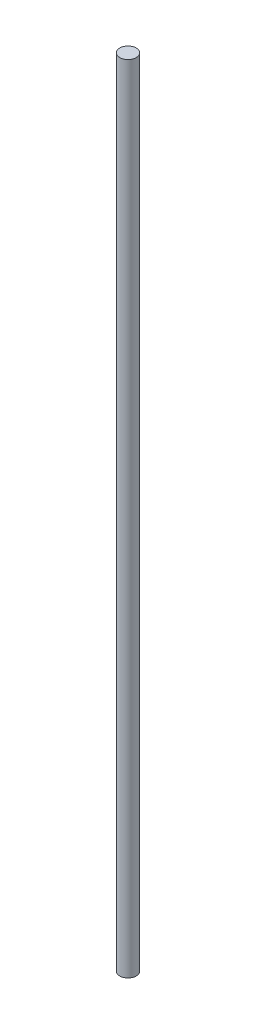
ISO-10303-21;
HEADER;
FILE_DESCRIPTION(('STEP AP214'),'2;1');
FILE_NAME('part.step','',(''),(''),'','','');
FILE_SCHEMA(('AUTOMOTIVE_DESIGN { 1 0 10303 214 1 1 1 1 }'));
ENDSEC;
DATA;
#1=APPLICATION_CONTEXT('core data for automotive mechanical design processes');
#2=APPLICATION_PROTOCOL_DEFINITION('international standard','automotive_design',2000,#1);
#3=PRODUCT_CONTEXT('',#1,'mechanical');
#4=PRODUCT('Part','Part','',(#3));
#5=PRODUCT_RELATED_PRODUCT_CATEGORY('part','',(#4));
#6=PRODUCT_DEFINITION_FORMATION('','',#4);
#7=PRODUCT_DEFINITION_CONTEXT('part definition',#1,'design');
#8=PRODUCT_DEFINITION('design','',#6,#7);
#9=PRODUCT_DEFINITION_SHAPE('','',#8);
#10=(LENGTH_UNIT() NAMED_UNIT(*) SI_UNIT(.MILLI.,.METRE.));
#11=(NAMED_UNIT(*) PLANE_ANGLE_UNIT() SI_UNIT($,.RADIAN.));
#12=(NAMED_UNIT(*) SI_UNIT($,.STERADIAN.) SOLID_ANGLE_UNIT());
#13=UNCERTAINTY_MEASURE_WITH_UNIT(LENGTH_MEASURE(1.E-05),#10,'distance_accuracy_value','');
#14=(GEOMETRIC_REPRESENTATION_CONTEXT(3) GLOBAL_UNCERTAINTY_ASSIGNED_CONTEXT((#13)) GLOBAL_UNIT_ASSIGNED_CONTEXT((#10,
#11,#12)) REPRESENTATION_CONTEXT('',''));
#15=CARTESIAN_POINT('',(0.,0.,0.));
#16=DIRECTION('',(0.,0.,1.));
#17=DIRECTION('',(1.,0.,0.));
#18=AXIS2_PLACEMENT_3D('',#15,#16,#17);
#19=CARTESIAN_POINT('',(0.,304.8,0.));
#20=DIRECTION('',(0.,-1.,0.));
#21=DIRECTION('',(0.,0.,-1.));
#22=AXIS2_PLACEMENT_3D('',#19,#20,#21);
#23=CYLINDRICAL_SURFACE('',#22,6.35);
#24=CARTESIAN_POINT('',(0.,304.8,0.));
#25=DIRECTION('',(0.,1.,0.));
#26=DIRECTION('',(0.,0.,1.));
#27=AXIS2_PLACEMENT_3D('',#24,#25,#26);
#28=CIRCLE('',#27,6.35);
#29=CARTESIAN_POINT('',(0.,304.8,6.35));
#30=VERTEX_POINT('',#29);
#31=EDGE_CURVE('E10',#30,#30,#28,.T.);
#32=ORIENTED_EDGE('',*,*,#31,.F.);
#33=EDGE_LOOP('',(#32));
#34=FACE_BOUND('',#33,.T.);
#35=CARTESIAN_POINT('',(0.,-304.8,0.));
#36=DIRECTION('',(0.,1.,0.));
#37=DIRECTION('',(0.,0.,1.));
#38=AXIS2_PLACEMENT_3D('',#35,#36,#37);
#39=CIRCLE('',#38,6.35);
#40=CARTESIAN_POINT('',(0.,-304.8,6.35));
#41=VERTEX_POINT('',#40);
#42=EDGE_CURVE('E38',#41,#41,#39,.T.);
#43=ORIENTED_EDGE('',*,*,#42,.T.);
#44=EDGE_LOOP('',(#43));
#45=FACE_BOUND('',#44,.T.);
#46=ADVANCED_FACE('F35',(#34,#45),#23,.T.);
#47=CARTESIAN_POINT('',(0.,304.8,0.));
#48=DIRECTION('',(0.,1.,0.));
#49=DIRECTION('',(0.,0.,1.));
#50=AXIS2_PLACEMENT_3D('',#47,#48,#49);
#51=PLANE('',#50);
#52=ORIENTED_EDGE('',*,*,#31,.T.);
#53=EDGE_LOOP('',(#52));
#54=FACE_BOUND('',#53,.T.);
#55=ADVANCED_FACE('F50',(#54),#51,.T.);
#56=CARTESIAN_POINT('',(0.,-304.8,0.));
#57=DIRECTION('',(0.,1.,0.));
#58=DIRECTION('',(0.,0.,1.));
#59=AXIS2_PLACEMENT_3D('',#56,#57,#58);
#60=PLANE('',#59);
#61=ORIENTED_EDGE('',*,*,#42,.F.);
#62=EDGE_LOOP('',(#61));
#63=FACE_BOUND('',#62,.T.);
#64=ADVANCED_FACE('F48',(#63),#60,.F.);
#65=CLOSED_SHELL('',(#46,#55,#64));
#66=MANIFOLD_SOLID_BREP('B2',#65);
#67=ADVANCED_BREP_SHAPE_REPRESENTATION('',(#18,#66),#14);
#68=SHAPE_DEFINITION_REPRESENTATION(#9,#67);
ENDSEC;
END-ISO-10303-21;
